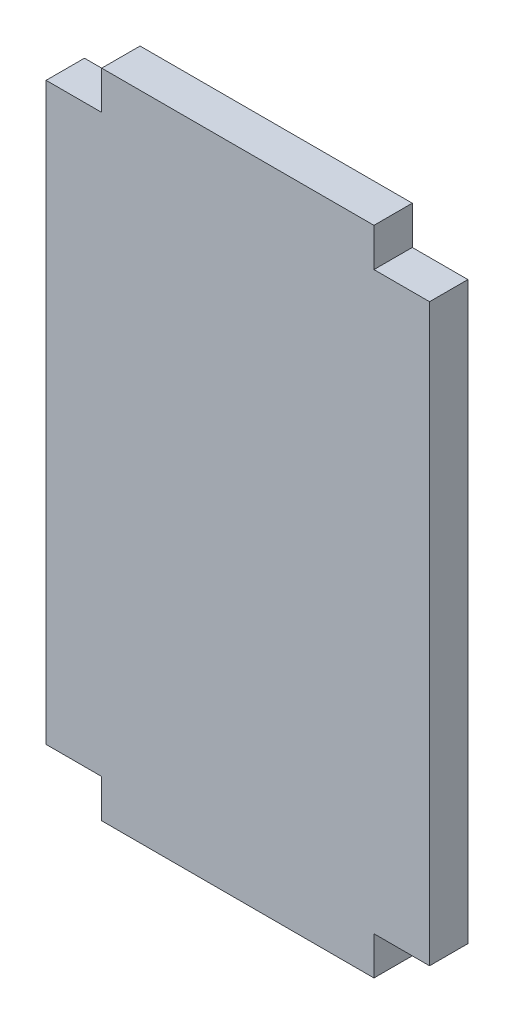
ISO-10303-21;
HEADER;
FILE_DESCRIPTION(('STEP AP214'),'2;1');
FILE_NAME('part.step','',(''),(''),'','','');
FILE_SCHEMA(('AUTOMOTIVE_DESIGN { 1 0 10303 214 1 1 1 1 }'));
ENDSEC;
DATA;
#1=APPLICATION_CONTEXT('core data for automotive mechanical design processes');
#2=APPLICATION_PROTOCOL_DEFINITION('international standard','automotive_design',2000,#1);
#3=PRODUCT_CONTEXT('',#1,'mechanical');
#4=PRODUCT('Part','Part','',(#3));
#5=PRODUCT_RELATED_PRODUCT_CATEGORY('part','',(#4));
#6=PRODUCT_DEFINITION_FORMATION('','',#4);
#7=PRODUCT_DEFINITION_CONTEXT('part definition',#1,'design');
#8=PRODUCT_DEFINITION('design','',#6,#7);
#9=PRODUCT_DEFINITION_SHAPE('','',#8);
#10=(LENGTH_UNIT() NAMED_UNIT(*) SI_UNIT(.MILLI.,.METRE.));
#11=(NAMED_UNIT(*) PLANE_ANGLE_UNIT() SI_UNIT($,.RADIAN.));
#12=(NAMED_UNIT(*) SI_UNIT($,.STERADIAN.) SOLID_ANGLE_UNIT());
#13=UNCERTAINTY_MEASURE_WITH_UNIT(LENGTH_MEASURE(1.E-05),#10,'distance_accuracy_value','');
#14=(GEOMETRIC_REPRESENTATION_CONTEXT(3) GLOBAL_UNCERTAINTY_ASSIGNED_CONTEXT((#13)) GLOBAL_UNIT_ASSIGNED_CONTEXT((#10,
#11,#12)) REPRESENTATION_CONTEXT('',''));
#15=CARTESIAN_POINT('',(0.,0.,0.));
#16=DIRECTION('',(0.,0.,1.));
#17=DIRECTION('',(1.,0.,0.));
#18=AXIS2_PLACEMENT_3D('',#15,#16,#17);
#19=CARTESIAN_POINT('',(0.,0.,5.08));
#20=DIRECTION('',(-1.,0.,0.));
#21=DIRECTION('',(0.,-1.,0.));
#22=AXIS2_PLACEMENT_3D('',#19,#20,#21);
#23=PLANE('',#22);
#24=DIRECTION('',(0.,0.,1.));
#25=VECTOR('',#24,1.);
#26=CARTESIAN_POINT('',(0.,5.08,0.));
#27=LINE('',#26,#25);
#28=CARTESIAN_POINT('',(0.,5.08,0.));
#29=VERTEX_POINT('',#28);
#30=CARTESIAN_POINT('',(0.,5.08,5.08));
#31=VERTEX_POINT('',#30);
#32=EDGE_CURVE('E156',#29,#31,#27,.T.);
#33=ORIENTED_EDGE('',*,*,#32,.F.);
#34=DIRECTION('',(0.,1.,0.));
#35=VECTOR('',#34,1.);
#36=CARTESIAN_POINT('',(0.,0.,0.));
#37=LINE('',#36,#35);
#38=CARTESIAN_POINT('',(0.,81.28,0.));
#39=VERTEX_POINT('',#38);
#40=EDGE_CURVE('E181',#29,#39,#37,.T.);
#41=ORIENTED_EDGE('',*,*,#40,.T.);
#42=DIRECTION('',(0.,0.,-1.));
#43=VECTOR('',#42,1.);
#44=CARTESIAN_POINT('',(0.,81.28,0.));
#45=LINE('',#44,#43);
#46=CARTESIAN_POINT('',(0.,81.28,5.08));
#47=VERTEX_POINT('',#46);
#48=EDGE_CURVE('E193',#47,#39,#45,.T.);
#49=ORIENTED_EDGE('',*,*,#48,.F.);
#50=DIRECTION('',(0.,1.,0.));
#51=VECTOR('',#50,1.);
#52=CARTESIAN_POINT('',(0.,0.,5.08));
#53=LINE('',#52,#51);
#54=EDGE_CURVE('E201',#31,#47,#53,.T.);
#55=ORIENTED_EDGE('',*,*,#54,.F.);
#56=EDGE_LOOP('',(#33,#41,#49,#55));
#57=FACE_BOUND('',#56,.T.);
#58=ADVANCED_FACE('F34',(#57),#23,.F.);
#59=CARTESIAN_POINT('',(-50.8,0.,5.08));
#60=DIRECTION('',(1.,0.,0.));
#61=DIRECTION('',(0.,0.,-1.));
#62=AXIS2_PLACEMENT_3D('',#59,#60,#61);
#63=PLANE('',#62);
#64=DIRECTION('',(0.,0.,-1.));
#65=VECTOR('',#64,1.);
#66=CARTESIAN_POINT('',(-50.8,5.08,0.));
#67=LINE('',#66,#65);
#68=CARTESIAN_POINT('',(-50.8,5.08,5.08));
#69=VERTEX_POINT('',#68);
#70=CARTESIAN_POINT('',(-50.8,5.08,0.));
#71=VERTEX_POINT('',#70);
#72=EDGE_CURVE('E135',#69,#71,#67,.T.);
#73=ORIENTED_EDGE('',*,*,#72,.F.);
#74=DIRECTION('',(0.,-1.,0.));
#75=VECTOR('',#74,1.);
#76=CARTESIAN_POINT('',(-50.8,0.,5.08));
#77=LINE('',#76,#75);
#78=CARTESIAN_POINT('',(-50.8,81.28,5.08));
#79=VERTEX_POINT('',#78);
#80=EDGE_CURVE('E42',#79,#69,#77,.T.);
#81=ORIENTED_EDGE('',*,*,#80,.F.);
#82=DIRECTION('',(0.,0.,1.));
#83=VECTOR('',#82,1.);
#84=CARTESIAN_POINT('',(-50.8,81.28,0.));
#85=LINE('',#84,#83);
#86=CARTESIAN_POINT('',(-50.8,81.28,0.));
#87=VERTEX_POINT('',#86);
#88=EDGE_CURVE('E170',#87,#79,#85,.T.);
#89=ORIENTED_EDGE('',*,*,#88,.F.);
#90=DIRECTION('',(0.,-1.,0.));
#91=VECTOR('',#90,1.);
#92=CARTESIAN_POINT('',(-50.8,0.,0.));
#93=LINE('',#92,#91);
#94=EDGE_CURVE('E211',#87,#71,#93,.T.);
#95=ORIENTED_EDGE('',*,*,#94,.T.);
#96=EDGE_LOOP('',(#73,#81,#89,#95));
#97=FACE_BOUND('',#96,.T.);
#98=ADVANCED_FACE('F220',(#97),#63,.F.);
#99=CARTESIAN_POINT('',(0.,0.,5.08));
#100=DIRECTION('',(0.,0.,1.));
#101=DIRECTION('',(1.,0.,0.));
#102=AXIS2_PLACEMENT_3D('',#99,#100,#101);
#103=PLANE('',#102);
#104=DIRECTION('',(0.,-1.,0.));
#105=VECTOR('',#104,1.);
#106=CARTESIAN_POINT('',(-43.435,5.08,5.08));
#107=LINE('',#106,#105);
#108=CARTESIAN_POINT('',(-43.435,5.08,5.08));
#109=VERTEX_POINT('',#108);
#110=CARTESIAN_POINT('',(-43.435,0.,5.08));
#111=VERTEX_POINT('',#110);
#112=EDGE_CURVE('E126',#109,#111,#107,.T.);
#113=ORIENTED_EDGE('',*,*,#112,.T.);
#114=DIRECTION('',(1.,0.,0.));
#115=VECTOR('',#114,1.);
#116=CARTESIAN_POINT('',(0.,0.,5.08));
#117=LINE('',#116,#115);
#118=CARTESIAN_POINT('',(-7.365,0.,5.08));
#119=VERTEX_POINT('',#118);
#120=EDGE_CURVE('E11',#111,#119,#117,.T.);
#121=ORIENTED_EDGE('',*,*,#120,.T.);
#122=DIRECTION('',(0.,-1.,0.));
#123=VECTOR('',#122,1.);
#124=CARTESIAN_POINT('',(-7.365,5.08,5.08));
#125=LINE('',#124,#123);
#126=CARTESIAN_POINT('',(-7.365,5.08,5.08));
#127=VERTEX_POINT('',#126);
#128=EDGE_CURVE('E50',#127,#119,#125,.T.);
#129=ORIENTED_EDGE('',*,*,#128,.F.);
#130=DIRECTION('',(-1.,0.,0.));
#131=VECTOR('',#130,1.);
#132=CARTESIAN_POINT('',(0.,5.08,5.08));
#133=LINE('',#132,#131);
#134=EDGE_CURVE('E158',#31,#127,#133,.T.);
#135=ORIENTED_EDGE('',*,*,#134,.F.);
#136=ORIENTED_EDGE('',*,*,#54,.T.);
#137=DIRECTION('',(1.,0.,0.));
#138=VECTOR('',#137,1.);
#139=CARTESIAN_POINT('',(0.,81.28,5.08));
#140=LINE('',#139,#138);
#141=CARTESIAN_POINT('',(-7.366,81.28,5.08));
#142=VERTEX_POINT('',#141);
#143=EDGE_CURVE('E190',#142,#47,#140,.T.);
#144=ORIENTED_EDGE('',*,*,#143,.F.);
#145=DIRECTION('',(0.,1.,0.));
#146=VECTOR('',#145,1.);
#147=CARTESIAN_POINT('',(-7.366,81.28,5.08));
#148=LINE('',#147,#146);
#149=CARTESIAN_POINT('',(-7.366,86.36,5.08));
#150=VERTEX_POINT('',#149);
#151=EDGE_CURVE('E178',#142,#150,#148,.T.);
#152=ORIENTED_EDGE('',*,*,#151,.T.);
#153=DIRECTION('',(-1.,0.,0.));
#154=VECTOR('',#153,1.);
#155=CARTESIAN_POINT('',(0.,86.36,5.08));
#156=LINE('',#155,#154);
#157=CARTESIAN_POINT('',(-43.434,86.36,5.08));
#158=VERTEX_POINT('',#157);
#159=EDGE_CURVE('E203',#150,#158,#156,.T.);
#160=ORIENTED_EDGE('',*,*,#159,.T.);
#161=DIRECTION('',(0.,1.,0.));
#162=VECTOR('',#161,1.);
#163=CARTESIAN_POINT('',(-43.434,81.28,5.08));
#164=LINE('',#163,#162);
#165=CARTESIAN_POINT('',(-43.434,81.28,5.08));
#166=VERTEX_POINT('',#165);
#167=EDGE_CURVE('E179',#166,#158,#164,.T.);
#168=ORIENTED_EDGE('',*,*,#167,.F.);
#169=DIRECTION('',(1.,0.,0.));
#170=VECTOR('',#169,1.);
#171=CARTESIAN_POINT('',(0.,81.28,5.08));
#172=LINE('',#171,#170);
#173=EDGE_CURVE('E172',#79,#166,#172,.T.);
#174=ORIENTED_EDGE('',*,*,#173,.F.);
#175=ORIENTED_EDGE('',*,*,#80,.T.);
#176=DIRECTION('',(-1.,0.,0.));
#177=VECTOR('',#176,1.);
#178=CARTESIAN_POINT('',(0.,5.08,5.08));
#179=LINE('',#178,#177);
#180=EDGE_CURVE('E129',#109,#69,#179,.T.);
#181=ORIENTED_EDGE('',*,*,#180,.F.);
#182=EDGE_LOOP('',(#113,#121,#129,#135,#136,#144,#152,#160,#168,#174,#175,#181));
#183=FACE_BOUND('',#182,.T.);
#184=ADVANCED_FACE('F222',(#183),#103,.T.);
#185=CARTESIAN_POINT('',(0.,0.,0.));
#186=DIRECTION('',(0.,0.,1.));
#187=DIRECTION('',(1.,0.,0.));
#188=AXIS2_PLACEMENT_3D('',#185,#186,#187);
#189=PLANE('',#188);
#190=DIRECTION('',(1.,0.,0.));
#191=VECTOR('',#190,1.);
#192=CARTESIAN_POINT('',(0.,0.,0.));
#193=LINE('',#192,#191);
#194=CARTESIAN_POINT('',(-43.435,0.,0.));
#195=VERTEX_POINT('',#194);
#196=CARTESIAN_POINT('',(-7.365,0.,0.));
#197=VERTEX_POINT('',#196);
#198=EDGE_CURVE('E37',#195,#197,#193,.T.);
#199=ORIENTED_EDGE('',*,*,#198,.F.);
#200=DIRECTION('',(0.,-1.,0.));
#201=VECTOR('',#200,1.);
#202=CARTESIAN_POINT('',(-43.435,5.08,0.));
#203=LINE('',#202,#201);
#204=CARTESIAN_POINT('',(-43.435,5.08,0.));
#205=VERTEX_POINT('',#204);
#206=EDGE_CURVE('E58',#205,#195,#203,.T.);
#207=ORIENTED_EDGE('',*,*,#206,.F.);
#208=DIRECTION('',(1.,0.,0.));
#209=VECTOR('',#208,1.);
#210=CARTESIAN_POINT('',(0.,5.08,0.));
#211=LINE('',#210,#209);
#212=EDGE_CURVE('E130',#71,#205,#211,.T.);
#213=ORIENTED_EDGE('',*,*,#212,.F.);
#214=ORIENTED_EDGE('',*,*,#94,.F.);
#215=DIRECTION('',(-1.,0.,0.));
#216=VECTOR('',#215,1.);
#217=CARTESIAN_POINT('',(0.,81.28,0.));
#218=LINE('',#217,#216);
#219=CARTESIAN_POINT('',(-43.434,81.28,0.));
#220=VERTEX_POINT('',#219);
#221=EDGE_CURVE('E167',#220,#87,#218,.T.);
#222=ORIENTED_EDGE('',*,*,#221,.F.);
#223=DIRECTION('',(0.,1.,0.));
#224=VECTOR('',#223,1.);
#225=CARTESIAN_POINT('',(-43.434,81.28,0.));
#226=LINE('',#225,#224);
#227=CARTESIAN_POINT('',(-43.434,86.36,0.));
#228=VERTEX_POINT('',#227);
#229=EDGE_CURVE('E175',#220,#228,#226,.T.);
#230=ORIENTED_EDGE('',*,*,#229,.T.);
#231=DIRECTION('',(-1.,0.,0.));
#232=VECTOR('',#231,1.);
#233=CARTESIAN_POINT('',(0.,86.36,0.));
#234=LINE('',#233,#232);
#235=CARTESIAN_POINT('',(-7.366,86.36,0.));
#236=VERTEX_POINT('',#235);
#237=EDGE_CURVE('E209',#236,#228,#234,.T.);
#238=ORIENTED_EDGE('',*,*,#237,.F.);
#239=DIRECTION('',(0.,1.,0.));
#240=VECTOR('',#239,1.);
#241=CARTESIAN_POINT('',(-7.366,81.28,0.));
#242=LINE('',#241,#240);
#243=CARTESIAN_POINT('',(-7.366,81.28,0.));
#244=VERTEX_POINT('',#243);
#245=EDGE_CURVE('E196',#244,#236,#242,.T.);
#246=ORIENTED_EDGE('',*,*,#245,.F.);
#247=DIRECTION('',(-1.,0.,0.));
#248=VECTOR('',#247,1.);
#249=CARTESIAN_POINT('',(0.,81.28,0.));
#250=LINE('',#249,#248);
#251=EDGE_CURVE('E184',#39,#244,#250,.T.);
#252=ORIENTED_EDGE('',*,*,#251,.F.);
#253=ORIENTED_EDGE('',*,*,#40,.F.);
#254=DIRECTION('',(1.,0.,0.));
#255=VECTOR('',#254,1.);
#256=CARTESIAN_POINT('',(0.,5.08,0.));
#257=LINE('',#256,#255);
#258=CARTESIAN_POINT('',(-7.365,5.08,0.));
#259=VERTEX_POINT('',#258);
#260=EDGE_CURVE('E153',#259,#29,#257,.T.);
#261=ORIENTED_EDGE('',*,*,#260,.F.);
#262=DIRECTION('',(0.,-1.,0.));
#263=VECTOR('',#262,1.);
#264=CARTESIAN_POINT('',(-7.365,5.08,0.));
#265=LINE('',#264,#263);
#266=EDGE_CURVE('E161',#259,#197,#265,.T.);
#267=ORIENTED_EDGE('',*,*,#266,.T.);
#268=EDGE_LOOP('',(#199,#207,#213,#214,#222,#230,#238,#246,#252,#253,#261,#267));
#269=FACE_BOUND('',#268,.T.);
#270=ADVANCED_FACE('F142',(#269),#189,.F.);
#271=CARTESIAN_POINT('',(0.,0.,5.08));
#272=DIRECTION('',(0.,1.,0.));
#273=DIRECTION('',(-1.,0.,0.));
#274=AXIS2_PLACEMENT_3D('',#271,#272,#273);
#275=PLANE('',#274);
#276=ORIENTED_EDGE('',*,*,#120,.F.);
#277=DIRECTION('',(0.,0.,1.));
#278=VECTOR('',#277,1.);
#279=CARTESIAN_POINT('',(-43.435,0.,0.));
#280=LINE('',#279,#278);
#281=EDGE_CURVE('E139',#195,#111,#280,.T.);
#282=ORIENTED_EDGE('',*,*,#281,.F.);
#283=ORIENTED_EDGE('',*,*,#198,.T.);
#284=DIRECTION('',(0.,0.,1.));
#285=VECTOR('',#284,1.);
#286=CARTESIAN_POINT('',(-7.365,0.,0.));
#287=LINE('',#286,#285);
#288=EDGE_CURVE('E154',#197,#119,#287,.T.);
#289=ORIENTED_EDGE('',*,*,#288,.T.);
#290=EDGE_LOOP('',(#276,#282,#283,#289));
#291=FACE_BOUND('',#290,.T.);
#292=ADVANCED_FACE('F216',(#291),#275,.F.);
#293=CARTESIAN_POINT('',(0.,86.36,5.08));
#294=DIRECTION('',(0.,-1.,0.));
#295=DIRECTION('',(0.,0.,-1.));
#296=AXIS2_PLACEMENT_3D('',#293,#294,#295);
#297=PLANE('',#296);
#298=DIRECTION('',(0.,0.,1.));
#299=VECTOR('',#298,1.);
#300=CARTESIAN_POINT('',(-43.434,86.36,0.));
#301=LINE('',#300,#299);
#302=EDGE_CURVE('E168',#228,#158,#301,.T.);
#303=ORIENTED_EDGE('',*,*,#302,.T.);
#304=ORIENTED_EDGE('',*,*,#159,.F.);
#305=DIRECTION('',(0.,0.,1.));
#306=VECTOR('',#305,1.);
#307=CARTESIAN_POINT('',(-7.366,86.36,0.));
#308=LINE('',#307,#306);
#309=EDGE_CURVE('E146',#236,#150,#308,.T.);
#310=ORIENTED_EDGE('',*,*,#309,.F.);
#311=ORIENTED_EDGE('',*,*,#237,.T.);
#312=EDGE_LOOP('',(#303,#304,#310,#311));
#313=FACE_BOUND('',#312,.T.);
#314=ADVANCED_FACE('F233',(#313),#297,.F.);
#315=CARTESIAN_POINT('',(-7.366,81.28,0.));
#316=DIRECTION('',(-1.,0.,0.));
#317=DIRECTION('',(0.,0.,1.));
#318=AXIS2_PLACEMENT_3D('',#315,#316,#317);
#319=PLANE('',#318);
#320=ORIENTED_EDGE('',*,*,#309,.T.);
#321=ORIENTED_EDGE('',*,*,#151,.F.);
#322=DIRECTION('',(0.,0.,1.));
#323=VECTOR('',#322,1.);
#324=CARTESIAN_POINT('',(-7.366,81.28,0.));
#325=LINE('',#324,#323);
#326=EDGE_CURVE('E187',#244,#142,#325,.T.);
#327=ORIENTED_EDGE('',*,*,#326,.F.);
#328=ORIENTED_EDGE('',*,*,#245,.T.);
#329=EDGE_LOOP('',(#320,#321,#327,#328));
#330=FACE_BOUND('',#329,.T.);
#331=ADVANCED_FACE('F236',(#330),#319,.F.);
#332=CARTESIAN_POINT('',(0.,81.28,0.));
#333=DIRECTION('',(0.,1.,0.));
#334=DIRECTION('',(0.,0.,1.));
#335=AXIS2_PLACEMENT_3D('',#332,#333,#334);
#336=PLANE('',#335);
#337=ORIENTED_EDGE('',*,*,#251,.T.);
#338=ORIENTED_EDGE('',*,*,#326,.T.);
#339=ORIENTED_EDGE('',*,*,#143,.T.);
#340=ORIENTED_EDGE('',*,*,#48,.T.);
#341=EDGE_LOOP('',(#337,#338,#339,#340));
#342=FACE_BOUND('',#341,.T.);
#343=ADVANCED_FACE('F242',(#342),#336,.T.);
#344=CARTESIAN_POINT('',(-43.434,81.28,0.));
#345=DIRECTION('',(-1.,0.,0.));
#346=DIRECTION('',(0.,0.,1.));
#347=AXIS2_PLACEMENT_3D('',#344,#345,#346);
#348=PLANE('',#347);
#349=ORIENTED_EDGE('',*,*,#302,.F.);
#350=ORIENTED_EDGE('',*,*,#229,.F.);
#351=DIRECTION('',(0.,0.,1.));
#352=VECTOR('',#351,1.);
#353=CARTESIAN_POINT('',(-43.434,81.28,0.));
#354=LINE('',#353,#352);
#355=EDGE_CURVE('E165',#220,#166,#354,.T.);
#356=ORIENTED_EDGE('',*,*,#355,.T.);
#357=ORIENTED_EDGE('',*,*,#167,.T.);
#358=EDGE_LOOP('',(#349,#350,#356,#357));
#359=FACE_BOUND('',#358,.T.);
#360=ADVANCED_FACE('F259',(#359),#348,.T.);
#361=CARTESIAN_POINT('',(0.,81.28,0.));
#362=DIRECTION('',(0.,1.,0.));
#363=DIRECTION('',(0.,0.,1.));
#364=AXIS2_PLACEMENT_3D('',#361,#362,#363);
#365=PLANE('',#364);
#366=ORIENTED_EDGE('',*,*,#355,.F.);
#367=ORIENTED_EDGE('',*,*,#221,.T.);
#368=ORIENTED_EDGE('',*,*,#88,.T.);
#369=ORIENTED_EDGE('',*,*,#173,.T.);
#370=EDGE_LOOP('',(#366,#367,#368,#369));
#371=FACE_BOUND('',#370,.T.);
#372=ADVANCED_FACE('F225',(#371),#365,.T.);
#373=CARTESIAN_POINT('',(-7.365,5.08,0.));
#374=DIRECTION('',(1.,0.,0.));
#375=DIRECTION('',(0.,1.,0.));
#376=AXIS2_PLACEMENT_3D('',#373,#374,#375);
#377=PLANE('',#376);
#378=ORIENTED_EDGE('',*,*,#288,.F.);
#379=ORIENTED_EDGE('',*,*,#266,.F.);
#380=DIRECTION('',(0.,0.,1.));
#381=VECTOR('',#380,1.);
#382=CARTESIAN_POINT('',(-7.365,5.08,0.));
#383=LINE('',#382,#381);
#384=EDGE_CURVE('E151',#259,#127,#383,.T.);
#385=ORIENTED_EDGE('',*,*,#384,.T.);
#386=ORIENTED_EDGE('',*,*,#128,.T.);
#387=EDGE_LOOP('',(#378,#379,#385,#386));
#388=FACE_BOUND('',#387,.T.);
#389=ADVANCED_FACE('F251',(#388),#377,.T.);
#390=CARTESIAN_POINT('',(0.,5.08,0.));
#391=DIRECTION('',(0.,-1.,0.));
#392=DIRECTION('',(1.,0.,0.));
#393=AXIS2_PLACEMENT_3D('',#390,#391,#392);
#394=PLANE('',#393);
#395=ORIENTED_EDGE('',*,*,#384,.F.);
#396=ORIENTED_EDGE('',*,*,#260,.T.);
#397=ORIENTED_EDGE('',*,*,#32,.T.);
#398=ORIENTED_EDGE('',*,*,#134,.T.);
#399=EDGE_LOOP('',(#395,#396,#397,#398));
#400=FACE_BOUND('',#399,.T.);
#401=ADVANCED_FACE('F250',(#400),#394,.T.);
#402=CARTESIAN_POINT('',(-43.435,5.08,0.));
#403=DIRECTION('',(1.,0.,0.));
#404=DIRECTION('',(0.,1.,0.));
#405=AXIS2_PLACEMENT_3D('',#402,#403,#404);
#406=PLANE('',#405);
#407=ORIENTED_EDGE('',*,*,#281,.T.);
#408=ORIENTED_EDGE('',*,*,#112,.F.);
#409=DIRECTION('',(0.,0.,1.));
#410=VECTOR('',#409,1.);
#411=CARTESIAN_POINT('',(-43.435,5.08,0.));
#412=LINE('',#411,#410);
#413=EDGE_CURVE('E122',#205,#109,#412,.T.);
#414=ORIENTED_EDGE('',*,*,#413,.F.);
#415=ORIENTED_EDGE('',*,*,#206,.T.);
#416=EDGE_LOOP('',(#407,#408,#414,#415));
#417=FACE_BOUND('',#416,.T.);
#418=ADVANCED_FACE('F124',(#417),#406,.F.);
#419=CARTESIAN_POINT('',(0.,5.08,0.));
#420=DIRECTION('',(0.,-1.,0.));
#421=DIRECTION('',(1.,0.,0.));
#422=AXIS2_PLACEMENT_3D('',#419,#420,#421);
#423=PLANE('',#422);
#424=ORIENTED_EDGE('',*,*,#212,.T.);
#425=ORIENTED_EDGE('',*,*,#413,.T.);
#426=ORIENTED_EDGE('',*,*,#180,.T.);
#427=ORIENTED_EDGE('',*,*,#72,.T.);
#428=EDGE_LOOP('',(#424,#425,#426,#427));
#429=FACE_BOUND('',#428,.T.);
#430=ADVANCED_FACE('F133',(#429),#423,.T.);
#431=CLOSED_SHELL('',(#58,#98,#184,#270,#292,#314,#331,#343,#360,#372,#389,#401,#418,#430));
#432=MANIFOLD_SOLID_BREP('B2',#431);
#433=ADVANCED_BREP_SHAPE_REPRESENTATION('',(#18,#432),#14);
#434=SHAPE_DEFINITION_REPRESENTATION(#9,#433);
ENDSEC;
END-ISO-10303-21;
